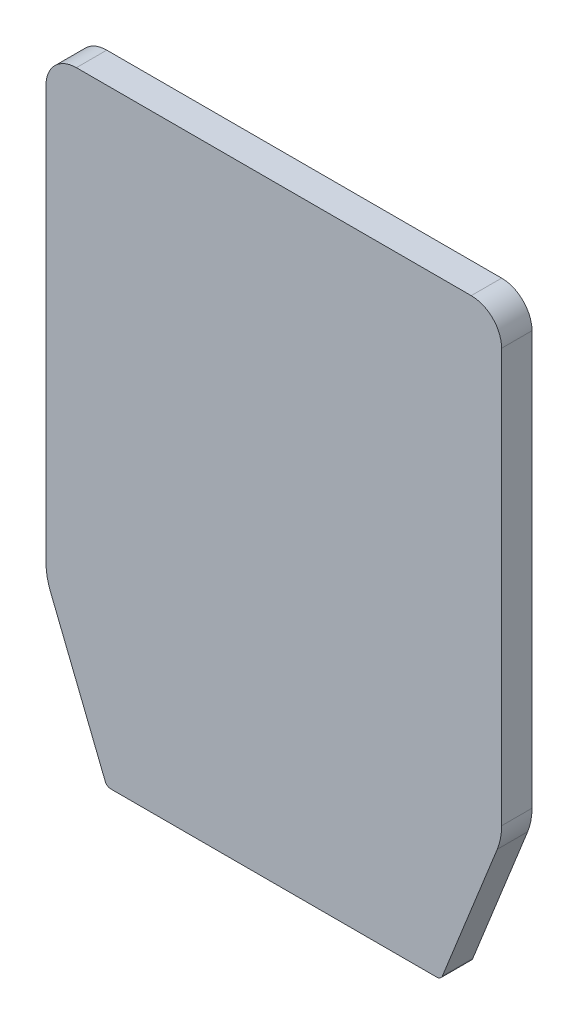
ISO-10303-21;
HEADER;
FILE_DESCRIPTION(('STEP AP214'),'2;1');
FILE_NAME('part.step','',(''),(''),'','','');
FILE_SCHEMA(('AUTOMOTIVE_DESIGN { 1 0 10303 214 1 1 1 1 }'));
ENDSEC;
DATA;
#1=APPLICATION_CONTEXT('core data for automotive mechanical design processes');
#2=APPLICATION_PROTOCOL_DEFINITION('international standard','automotive_design',2000,#1);
#3=PRODUCT_CONTEXT('',#1,'mechanical');
#4=PRODUCT('Part','Part','',(#3));
#5=PRODUCT_RELATED_PRODUCT_CATEGORY('part','',(#4));
#6=PRODUCT_DEFINITION_FORMATION('','',#4);
#7=PRODUCT_DEFINITION_CONTEXT('part definition',#1,'design');
#8=PRODUCT_DEFINITION('design','',#6,#7);
#9=PRODUCT_DEFINITION_SHAPE('','',#8);
#10=(LENGTH_UNIT() NAMED_UNIT(*) SI_UNIT(.MILLI.,.METRE.));
#11=(NAMED_UNIT(*) PLANE_ANGLE_UNIT() SI_UNIT($,.RADIAN.));
#12=(NAMED_UNIT(*) SI_UNIT($,.STERADIAN.) SOLID_ANGLE_UNIT());
#13=UNCERTAINTY_MEASURE_WITH_UNIT(LENGTH_MEASURE(1.E-05),#10,'distance_accuracy_value','');
#14=(GEOMETRIC_REPRESENTATION_CONTEXT(3) GLOBAL_UNCERTAINTY_ASSIGNED_CONTEXT((#13)) GLOBAL_UNIT_ASSIGNED_CONTEXT((#10,
#11,#12)) REPRESENTATION_CONTEXT('',''));
#15=CARTESIAN_POINT('',(0.,0.,0.));
#16=DIRECTION('',(0.,0.,1.));
#17=DIRECTION('',(1.,0.,0.));
#18=AXIS2_PLACEMENT_3D('',#15,#16,#17);
#19=CARTESIAN_POINT('',(55.,53.8516480713454,10.));
#20=DIRECTION('',(0.,0.,-1.));
#21=DIRECTION('',(-1.,0.,0.));
#22=AXIS2_PLACEMENT_3D('',#19,#20,#21);
#23=CYLINDRICAL_SURFACE('',#22,20.);
#24=CARTESIAN_POINT('',(55.,53.8516480713454,0.));
#25=DIRECTION('',(0.,0.,1.));
#26=DIRECTION('',(1.,0.,0.));
#27=AXIS2_PLACEMENT_3D('',#24,#25,#26);
#28=CIRCLE('',#27,20.);
#29=CARTESIAN_POINT('',(73.5695338177052,46.4238345442634,0.));
#30=VERTEX_POINT('',#29);
#31=CARTESIAN_POINT('',(75.,53.8516480713454,0.));
#32=VERTEX_POINT('',#31);
#33=EDGE_CURVE('E153',#30,#32,#28,.T.);
#34=ORIENTED_EDGE('',*,*,#33,.T.);
#35=DIRECTION('',(0.,0.,-1.));
#36=VECTOR('',#35,1.);
#37=CARTESIAN_POINT('',(75.,53.8516480713454,10.));
#38=LINE('',#37,#36);
#39=CARTESIAN_POINT('',(75.,53.8516480713454,10.));
#40=VERTEX_POINT('',#39);
#41=EDGE_CURVE('E11',#40,#32,#38,.T.);
#42=ORIENTED_EDGE('',*,*,#41,.F.);
#43=CARTESIAN_POINT('',(55.,53.8516480713454,10.));
#44=DIRECTION('',(0.,0.,1.));
#45=DIRECTION('',(1.,0.,0.));
#46=AXIS2_PLACEMENT_3D('',#43,#44,#45);
#47=CIRCLE('',#46,20.);
#48=CARTESIAN_POINT('',(73.5695338177052,46.4238345442634,10.));
#49=VERTEX_POINT('',#48);
#50=EDGE_CURVE('E175',#49,#40,#47,.T.);
#51=ORIENTED_EDGE('',*,*,#50,.F.);
#52=DIRECTION('',(0.,0.,-1.));
#53=VECTOR('',#52,1.);
#54=CARTESIAN_POINT('',(73.5695338177052,46.4238345442634,10.));
#55=LINE('',#54,#53);
#56=EDGE_CURVE('E149',#49,#30,#55,.T.);
#57=ORIENTED_EDGE('',*,*,#56,.T.);
#58=EDGE_LOOP('',(#34,#42,#51,#57));
#59=FACE_BOUND('',#58,.T.);
#60=ADVANCED_FACE('F33',(#59),#23,.T.);
#61=CARTESIAN_POINT('',(75.,190.,10.));
#62=DIRECTION('',(-1.,0.,0.));
#63=DIRECTION('',(0.,0.,1.));
#64=AXIS2_PLACEMENT_3D('',#61,#62,#63);
#65=PLANE('',#64);
#66=DIRECTION('',(0.,1.,0.));
#67=VECTOR('',#66,1.);
#68=CARTESIAN_POINT('',(75.,190.,0.));
#69=LINE('',#68,#67);
#70=CARTESIAN_POINT('',(75.,190.,0.));
#71=VERTEX_POINT('',#70);
#72=EDGE_CURVE('E156',#32,#71,#69,.T.);
#73=ORIENTED_EDGE('',*,*,#72,.T.);
#74=DIRECTION('',(0.,0.,-1.));
#75=VECTOR('',#74,1.);
#76=CARTESIAN_POINT('',(75.,190.,10.));
#77=LINE('',#76,#75);
#78=CARTESIAN_POINT('',(75.,190.,10.));
#79=VERTEX_POINT('',#78);
#80=EDGE_CURVE('E41',#79,#71,#77,.T.);
#81=ORIENTED_EDGE('',*,*,#80,.F.);
#82=DIRECTION('',(0.,1.,0.));
#83=VECTOR('',#82,1.);
#84=CARTESIAN_POINT('',(75.,190.,10.));
#85=LINE('',#84,#83);
#86=EDGE_CURVE('E104',#40,#79,#85,.T.);
#87=ORIENTED_EDGE('',*,*,#86,.F.);
#88=ORIENTED_EDGE('',*,*,#41,.T.);
#89=EDGE_LOOP('',(#73,#81,#87,#88));
#90=FACE_BOUND('',#89,.T.);
#91=ADVANCED_FACE('F253',(#90),#65,.F.);
#92=CARTESIAN_POINT('',(65.,190.,10.));
#93=DIRECTION('',(0.,0.,-1.));
#94=DIRECTION('',(-1.,0.,0.));
#95=AXIS2_PLACEMENT_3D('',#92,#93,#94);
#96=CYLINDRICAL_SURFACE('',#95,10.);
#97=CARTESIAN_POINT('',(65.,190.,0.));
#98=DIRECTION('',(0.,0.,1.));
#99=DIRECTION('',(1.,0.,0.));
#100=AXIS2_PLACEMENT_3D('',#97,#98,#99);
#101=CIRCLE('',#100,10.);
#102=CARTESIAN_POINT('',(65.,200.,0.));
#103=VERTEX_POINT('',#102);
#104=EDGE_CURVE('E158',#71,#103,#101,.T.);
#105=ORIENTED_EDGE('',*,*,#104,.T.);
#106=DIRECTION('',(0.,0.,-1.));
#107=VECTOR('',#106,1.);
#108=CARTESIAN_POINT('',(65.,200.,10.));
#109=LINE('',#108,#107);
#110=CARTESIAN_POINT('',(65.,200.,10.));
#111=VERTEX_POINT('',#110);
#112=EDGE_CURVE('E194',#111,#103,#109,.T.);
#113=ORIENTED_EDGE('',*,*,#112,.F.);
#114=CARTESIAN_POINT('',(65.,190.,10.));
#115=DIRECTION('',(0.,0.,1.));
#116=DIRECTION('',(1.,0.,0.));
#117=AXIS2_PLACEMENT_3D('',#114,#115,#116);
#118=CIRCLE('',#117,10.);
#119=EDGE_CURVE('E202',#79,#111,#118,.T.);
#120=ORIENTED_EDGE('',*,*,#119,.F.);
#121=ORIENTED_EDGE('',*,*,#80,.T.);
#122=EDGE_LOOP('',(#105,#113,#120,#121));
#123=FACE_BOUND('',#122,.T.);
#124=ADVANCED_FACE('F200',(#123),#96,.T.);
#125=CARTESIAN_POINT('',(-65.,200.,10.));
#126=DIRECTION('',(0.,-1.,0.));
#127=DIRECTION('',(0.,0.,-1.));
#128=AXIS2_PLACEMENT_3D('',#125,#126,#127);
#129=PLANE('',#128);
#130=DIRECTION('',(-1.,0.,0.));
#131=VECTOR('',#130,1.);
#132=CARTESIAN_POINT('',(-65.,200.,0.));
#133=LINE('',#132,#131);
#134=CARTESIAN_POINT('',(-65.,200.,0.));
#135=VERTEX_POINT('',#134);
#136=EDGE_CURVE('E160',#103,#135,#133,.T.);
#137=ORIENTED_EDGE('',*,*,#136,.T.);
#138=DIRECTION('',(0.,0.,-1.));
#139=VECTOR('',#138,1.);
#140=CARTESIAN_POINT('',(-65.,200.,10.));
#141=LINE('',#140,#139);
#142=CARTESIAN_POINT('',(-65.,200.,10.));
#143=VERTEX_POINT('',#142);
#144=EDGE_CURVE('E191',#143,#135,#141,.T.);
#145=ORIENTED_EDGE('',*,*,#144,.F.);
#146=DIRECTION('',(-1.,0.,0.));
#147=VECTOR('',#146,1.);
#148=CARTESIAN_POINT('',(-65.,200.,10.));
#149=LINE('',#148,#147);
#150=EDGE_CURVE('E220',#111,#143,#149,.T.);
#151=ORIENTED_EDGE('',*,*,#150,.F.);
#152=ORIENTED_EDGE('',*,*,#112,.T.);
#153=EDGE_LOOP('',(#137,#145,#151,#152));
#154=FACE_BOUND('',#153,.T.);
#155=ADVANCED_FACE('F211',(#154),#129,.F.);
#156=CARTESIAN_POINT('',(-65.,190.,10.));
#157=DIRECTION('',(0.,0.,-1.));
#158=DIRECTION('',(-1.,0.,0.));
#159=AXIS2_PLACEMENT_3D('',#156,#157,#158);
#160=CYLINDRICAL_SURFACE('',#159,9.99999999999999);
#161=CARTESIAN_POINT('',(-65.,190.,0.));
#162=DIRECTION('',(0.,0.,1.));
#163=DIRECTION('',(1.,0.,0.));
#164=AXIS2_PLACEMENT_3D('',#161,#162,#163);
#165=CIRCLE('',#164,9.99999999999999);
#166=CARTESIAN_POINT('',(-75.,190.,0.));
#167=VERTEX_POINT('',#166);
#168=EDGE_CURVE('E162',#135,#167,#165,.T.);
#169=ORIENTED_EDGE('',*,*,#168,.T.);
#170=DIRECTION('',(0.,0.,-1.));
#171=VECTOR('',#170,1.);
#172=CARTESIAN_POINT('',(-75.,190.,10.));
#173=LINE('',#172,#171);
#174=CARTESIAN_POINT('',(-75.,190.,10.));
#175=VERTEX_POINT('',#174);
#176=EDGE_CURVE('E188',#175,#167,#173,.T.);
#177=ORIENTED_EDGE('',*,*,#176,.F.);
#178=CARTESIAN_POINT('',(-65.,190.,10.));
#179=DIRECTION('',(0.,0.,1.));
#180=DIRECTION('',(1.,0.,0.));
#181=AXIS2_PLACEMENT_3D('',#178,#179,#180);
#182=CIRCLE('',#181,9.99999999999999);
#183=EDGE_CURVE('E217',#143,#175,#182,.T.);
#184=ORIENTED_EDGE('',*,*,#183,.F.);
#185=ORIENTED_EDGE('',*,*,#144,.T.);
#186=EDGE_LOOP('',(#169,#177,#184,#185));
#187=FACE_BOUND('',#186,.T.);
#188=ADVANCED_FACE('F215',(#187),#160,.T.);
#189=CARTESIAN_POINT('',(-75.,190.,10.));
#190=DIRECTION('',(1.,0.,0.));
#191=DIRECTION('',(0.,0.,-1.));
#192=AXIS2_PLACEMENT_3D('',#189,#190,#191);
#193=PLANE('',#192);
#194=DIRECTION('',(0.,-1.,0.));
#195=VECTOR('',#194,1.);
#196=CARTESIAN_POINT('',(-75.,190.,0.));
#197=LINE('',#196,#195);
#198=CARTESIAN_POINT('',(-75.,53.8516480713454,0.));
#199=VERTEX_POINT('',#198);
#200=EDGE_CURVE('E164',#167,#199,#197,.T.);
#201=ORIENTED_EDGE('',*,*,#200,.T.);
#202=DIRECTION('',(0.,0.,-1.));
#203=VECTOR('',#202,1.);
#204=CARTESIAN_POINT('',(-75.,53.8516480713454,10.));
#205=LINE('',#204,#203);
#206=CARTESIAN_POINT('',(-75.,53.8516480713454,10.));
#207=VERTEX_POINT('',#206);
#208=EDGE_CURVE('E185',#207,#199,#205,.T.);
#209=ORIENTED_EDGE('',*,*,#208,.F.);
#210=DIRECTION('',(0.,-1.,0.));
#211=VECTOR('',#210,1.);
#212=CARTESIAN_POINT('',(-75.,190.,10.));
#213=LINE('',#212,#211);
#214=EDGE_CURVE('E219',#175,#207,#213,.T.);
#215=ORIENTED_EDGE('',*,*,#214,.F.);
#216=ORIENTED_EDGE('',*,*,#176,.T.);
#217=EDGE_LOOP('',(#201,#209,#215,#216));
#218=FACE_BOUND('',#217,.T.);
#219=ADVANCED_FACE('F266',(#218),#193,.F.);
#220=CARTESIAN_POINT('',(-55.,53.8516480713454,10.));
#221=DIRECTION('',(0.,0.,-1.));
#222=DIRECTION('',(-1.,0.,0.));
#223=AXIS2_PLACEMENT_3D('',#220,#221,#222);
#224=CYLINDRICAL_SURFACE('',#223,20.);
#225=CARTESIAN_POINT('',(-55.,53.8516480713454,0.));
#226=DIRECTION('',(0.,0.,1.));
#227=DIRECTION('',(1.,0.,0.));
#228=AXIS2_PLACEMENT_3D('',#225,#226,#227);
#229=CIRCLE('',#228,20.);
#230=CARTESIAN_POINT('',(-73.5695338177052,46.4238345442634,0.));
#231=VERTEX_POINT('',#230);
#232=EDGE_CURVE('E166',#199,#231,#229,.T.);
#233=ORIENTED_EDGE('',*,*,#232,.T.);
#234=DIRECTION('',(0.,0.,-1.));
#235=VECTOR('',#234,1.);
#236=CARTESIAN_POINT('',(-73.5695338177052,46.4238345442634,10.));
#237=LINE('',#236,#235);
#238=CARTESIAN_POINT('',(-73.5695338177052,46.4238345442634,10.));
#239=VERTEX_POINT('',#238);
#240=EDGE_CURVE('E182',#239,#231,#237,.T.);
#241=ORIENTED_EDGE('',*,*,#240,.F.);
#242=CARTESIAN_POINT('',(-55.,53.8516480713454,10.));
#243=DIRECTION('',(0.,0.,1.));
#244=DIRECTION('',(1.,0.,0.));
#245=AXIS2_PLACEMENT_3D('',#242,#243,#244);
#246=CIRCLE('',#245,20.);
#247=EDGE_CURVE('E222',#207,#239,#246,.T.);
#248=ORIENTED_EDGE('',*,*,#247,.F.);
#249=ORIENTED_EDGE('',*,*,#208,.T.);
#250=EDGE_LOOP('',(#233,#241,#248,#249));
#251=FACE_BOUND('',#250,.T.);
#252=ADVANCED_FACE('F269',(#251),#224,.T.);
#253=CARTESIAN_POINT('',(-73.5695338177052,46.4238345442634,10.));
#254=DIRECTION('',(0.92847669088526,0.371390676354102,0.));
#255=DIRECTION('',(-0.371390676354102,0.92847669088526,0.));
#256=AXIS2_PLACEMENT_3D('',#253,#254,#255);
#257=PLANE('',#256);
#258=DIRECTION('',(0.371390676354102,-0.92847669088526,0.));
#259=VECTOR('',#258,1.);
#260=CARTESIAN_POINT('',(-73.5695338177052,46.4238345442634,0.));
#261=LINE('',#260,#259);
#262=CARTESIAN_POINT('',(-55.5028874589167,1.25721864729178,0.));
#263=VERTEX_POINT('',#262);
#264=EDGE_CURVE('E168',#231,#263,#261,.T.);
#265=ORIENTED_EDGE('',*,*,#264,.T.);
#266=DIRECTION('',(0.,0.,-1.));
#267=VECTOR('',#266,1.);
#268=CARTESIAN_POINT('',(-55.5028874589167,1.25721864729178,10.));
#269=LINE('',#268,#267);
#270=CARTESIAN_POINT('',(-55.5028874589167,1.25721864729178,10.));
#271=VERTEX_POINT('',#270);
#272=EDGE_CURVE('E179',#271,#263,#269,.T.);
#273=ORIENTED_EDGE('',*,*,#272,.F.);
#274=DIRECTION('',(0.371390676354102,-0.92847669088526,0.));
#275=VECTOR('',#274,1.);
#276=CARTESIAN_POINT('',(-73.5695338177052,46.4238345442634,10.));
#277=LINE('',#276,#275);
#278=EDGE_CURVE('E228',#239,#271,#277,.T.);
#279=ORIENTED_EDGE('',*,*,#278,.F.);
#280=ORIENTED_EDGE('',*,*,#240,.T.);
#281=EDGE_LOOP('',(#265,#273,#279,#280));
#282=FACE_BOUND('',#281,.T.);
#283=ADVANCED_FACE('F234',(#282),#257,.F.);
#284=CARTESIAN_POINT('',(-53.6459340771462,2.,10.));
#285=DIRECTION('',(0.,0.,-1.));
#286=DIRECTION('',(-1.,0.,0.));
#287=AXIS2_PLACEMENT_3D('',#284,#285,#286);
#288=CYLINDRICAL_SURFACE('',#287,2.00000000000001);
#289=CARTESIAN_POINT('',(-53.6459340771462,2.,0.));
#290=DIRECTION('',(0.,0.,1.));
#291=DIRECTION('',(1.,0.,0.));
#292=AXIS2_PLACEMENT_3D('',#289,#290,#291);
#293=CIRCLE('',#292,2.00000000000001);
#294=CARTESIAN_POINT('',(-53.6459340771462,0.,0.));
#295=VERTEX_POINT('',#294);
#296=EDGE_CURVE('E170',#263,#295,#293,.T.);
#297=ORIENTED_EDGE('',*,*,#296,.T.);
#298=DIRECTION('',(0.,0.,-1.));
#299=VECTOR('',#298,1.);
#300=CARTESIAN_POINT('',(-53.6459340771462,0.,10.));
#301=LINE('',#300,#299);
#302=CARTESIAN_POINT('',(-53.6459340771462,0.,10.));
#303=VERTEX_POINT('',#302);
#304=EDGE_CURVE('E144',#303,#295,#301,.T.);
#305=ORIENTED_EDGE('',*,*,#304,.F.);
#306=CARTESIAN_POINT('',(-53.6459340771462,2.,10.));
#307=DIRECTION('',(0.,0.,1.));
#308=DIRECTION('',(1.,0.,0.));
#309=AXIS2_PLACEMENT_3D('',#306,#307,#308);
#310=CIRCLE('',#309,2.00000000000001);
#311=EDGE_CURVE('E135',#271,#303,#310,.T.);
#312=ORIENTED_EDGE('',*,*,#311,.F.);
#313=ORIENTED_EDGE('',*,*,#272,.T.);
#314=EDGE_LOOP('',(#297,#305,#312,#313));
#315=FACE_BOUND('',#314,.T.);
#316=ADVANCED_FACE('F238',(#315),#288,.T.);
#317=CARTESIAN_POINT('',(-53.6459340771462,0.,10.));
#318=DIRECTION('',(0.,1.,0.));
#319=DIRECTION('',(0.,0.,1.));
#320=AXIS2_PLACEMENT_3D('',#317,#318,#319);
#321=PLANE('',#320);
#322=DIRECTION('',(1.,0.,0.));
#323=VECTOR('',#322,1.);
#324=CARTESIAN_POINT('',(-53.6459340771462,0.,0.));
#325=LINE('',#324,#323);
#326=CARTESIAN_POINT('',(53.6459340771462,0.,0.));
#327=VERTEX_POINT('',#326);
#328=EDGE_CURVE('E143',#295,#327,#325,.T.);
#329=ORIENTED_EDGE('',*,*,#328,.T.);
#330=DIRECTION('',(0.,0.,-1.));
#331=VECTOR('',#330,1.);
#332=CARTESIAN_POINT('',(53.6459340771462,0.,10.));
#333=LINE('',#332,#331);
#334=CARTESIAN_POINT('',(53.6459340771462,0.,10.));
#335=VERTEX_POINT('',#334);
#336=EDGE_CURVE('E140',#335,#327,#333,.T.);
#337=ORIENTED_EDGE('',*,*,#336,.F.);
#338=DIRECTION('',(1.,0.,0.));
#339=VECTOR('',#338,1.);
#340=CARTESIAN_POINT('',(-53.6459340771462,0.,10.));
#341=LINE('',#340,#339);
#342=EDGE_CURVE('E129',#303,#335,#341,.T.);
#343=ORIENTED_EDGE('',*,*,#342,.F.);
#344=ORIENTED_EDGE('',*,*,#304,.T.);
#345=EDGE_LOOP('',(#329,#337,#343,#344));
#346=FACE_BOUND('',#345,.T.);
#347=ADVANCED_FACE('F141',(#346),#321,.F.);
#348=CARTESIAN_POINT('',(53.6459340771462,2.,10.));
#349=DIRECTION('',(0.,0.,-1.));
#350=DIRECTION('',(-1.,0.,0.));
#351=AXIS2_PLACEMENT_3D('',#348,#349,#350);
#352=CYLINDRICAL_SURFACE('',#351,2.00000000000001);
#353=CARTESIAN_POINT('',(53.6459340771462,2.,0.));
#354=DIRECTION('',(0.,0.,1.));
#355=DIRECTION('',(1.,0.,0.));
#356=AXIS2_PLACEMENT_3D('',#353,#354,#355);
#357=CIRCLE('',#356,2.00000000000001);
#358=CARTESIAN_POINT('',(55.5028874589167,1.25721864729178,0.));
#359=VERTEX_POINT('',#358);
#360=EDGE_CURVE('E90',#327,#359,#357,.T.);
#361=ORIENTED_EDGE('',*,*,#360,.T.);
#362=DIRECTION('',(0.,0.,-1.));
#363=VECTOR('',#362,1.);
#364=CARTESIAN_POINT('',(55.5028874589167,1.25721864729178,10.));
#365=LINE('',#364,#363);
#366=CARTESIAN_POINT('',(55.5028874589167,1.25721864729178,10.));
#367=VERTEX_POINT('',#366);
#368=EDGE_CURVE('E145',#367,#359,#365,.T.);
#369=ORIENTED_EDGE('',*,*,#368,.F.);
#370=CARTESIAN_POINT('',(53.6459340771462,2.,10.));
#371=DIRECTION('',(0.,0.,1.));
#372=DIRECTION('',(1.,0.,0.));
#373=AXIS2_PLACEMENT_3D('',#370,#371,#372);
#374=CIRCLE('',#373,2.00000000000001);
#375=EDGE_CURVE('E133',#335,#367,#374,.T.);
#376=ORIENTED_EDGE('',*,*,#375,.F.);
#377=ORIENTED_EDGE('',*,*,#336,.T.);
#378=EDGE_LOOP('',(#361,#369,#376,#377));
#379=FACE_BOUND('',#378,.T.);
#380=ADVANCED_FACE('F147',(#379),#352,.T.);
#381=CARTESIAN_POINT('',(55.5028874589167,1.25721864729178,10.));
#382=DIRECTION('',(-0.92847669088526,0.371390676354102,0.));
#383=DIRECTION('',(-0.371390676354102,-0.92847669088526,0.));
#384=AXIS2_PLACEMENT_3D('',#381,#382,#383);
#385=PLANE('',#384);
#386=DIRECTION('',(0.371390676354102,0.92847669088526,0.));
#387=VECTOR('',#386,1.);
#388=CARTESIAN_POINT('',(55.5028874589167,1.25721864729178,0.));
#389=LINE('',#388,#387);
#390=EDGE_CURVE('E96',#359,#30,#389,.T.);
#391=ORIENTED_EDGE('',*,*,#390,.T.);
#392=ORIENTED_EDGE('',*,*,#56,.F.);
#393=DIRECTION('',(0.371390676354102,0.92847669088526,0.));
#394=VECTOR('',#393,1.);
#395=CARTESIAN_POINT('',(55.5028874589167,1.25721864729178,10.));
#396=LINE('',#395,#394);
#397=EDGE_CURVE('E49',#367,#49,#396,.T.);
#398=ORIENTED_EDGE('',*,*,#397,.F.);
#399=ORIENTED_EDGE('',*,*,#368,.T.);
#400=EDGE_LOOP('',(#391,#392,#398,#399));
#401=FACE_BOUND('',#400,.T.);
#402=ADVANCED_FACE('F242',(#401),#385,.F.);
#403=CARTESIAN_POINT('',(55.,53.8516480713454,10.));
#404=DIRECTION('',(0.,0.,1.));
#405=DIRECTION('',(1.,0.,0.));
#406=AXIS2_PLACEMENT_3D('',#403,#404,#405);
#407=PLANE('',#406);
#408=ORIENTED_EDGE('',*,*,#50,.T.);
#409=ORIENTED_EDGE('',*,*,#86,.T.);
#410=ORIENTED_EDGE('',*,*,#119,.T.);
#411=ORIENTED_EDGE('',*,*,#150,.T.);
#412=ORIENTED_EDGE('',*,*,#183,.T.);
#413=ORIENTED_EDGE('',*,*,#214,.T.);
#414=ORIENTED_EDGE('',*,*,#247,.T.);
#415=ORIENTED_EDGE('',*,*,#278,.T.);
#416=ORIENTED_EDGE('',*,*,#311,.T.);
#417=ORIENTED_EDGE('',*,*,#342,.T.);
#418=ORIENTED_EDGE('',*,*,#375,.T.);
#419=ORIENTED_EDGE('',*,*,#397,.T.);
#420=EDGE_LOOP('',(#408,#409,#410,#411,#412,#413,#414,#415,#416,#417,#418,#419));
#421=FACE_BOUND('',#420,.T.);
#422=ADVANCED_FACE('F131',(#421),#407,.T.);
#423=CARTESIAN_POINT('',(55.,53.8516480713454,0.));
#424=DIRECTION('',(0.,0.,1.));
#425=DIRECTION('',(1.,0.,0.));
#426=AXIS2_PLACEMENT_3D('',#423,#424,#425);
#427=PLANE('',#426);
#428=ORIENTED_EDGE('',*,*,#33,.F.);
#429=ORIENTED_EDGE('',*,*,#390,.F.);
#430=ORIENTED_EDGE('',*,*,#360,.F.);
#431=ORIENTED_EDGE('',*,*,#328,.F.);
#432=ORIENTED_EDGE('',*,*,#296,.F.);
#433=ORIENTED_EDGE('',*,*,#264,.F.);
#434=ORIENTED_EDGE('',*,*,#232,.F.);
#435=ORIENTED_EDGE('',*,*,#200,.F.);
#436=ORIENTED_EDGE('',*,*,#168,.F.);
#437=ORIENTED_EDGE('',*,*,#136,.F.);
#438=ORIENTED_EDGE('',*,*,#104,.F.);
#439=ORIENTED_EDGE('',*,*,#72,.F.);
#440=EDGE_LOOP('',(#428,#429,#430,#431,#432,#433,#434,#435,#436,#437,#438,#439));
#441=FACE_BOUND('',#440,.T.);
#442=ADVANCED_FACE('F206',(#441),#427,.F.);
#443=CLOSED_SHELL('',(#60,#91,#124,#155,#188,#219,#252,#283,#316,#347,#380,#402,#422,#442));
#444=MANIFOLD_SOLID_BREP('B2',#443);
#445=ADVANCED_BREP_SHAPE_REPRESENTATION('',(#18,#444),#14);
#446=SHAPE_DEFINITION_REPRESENTATION(#9,#445);
ENDSEC;
END-ISO-10303-21;
